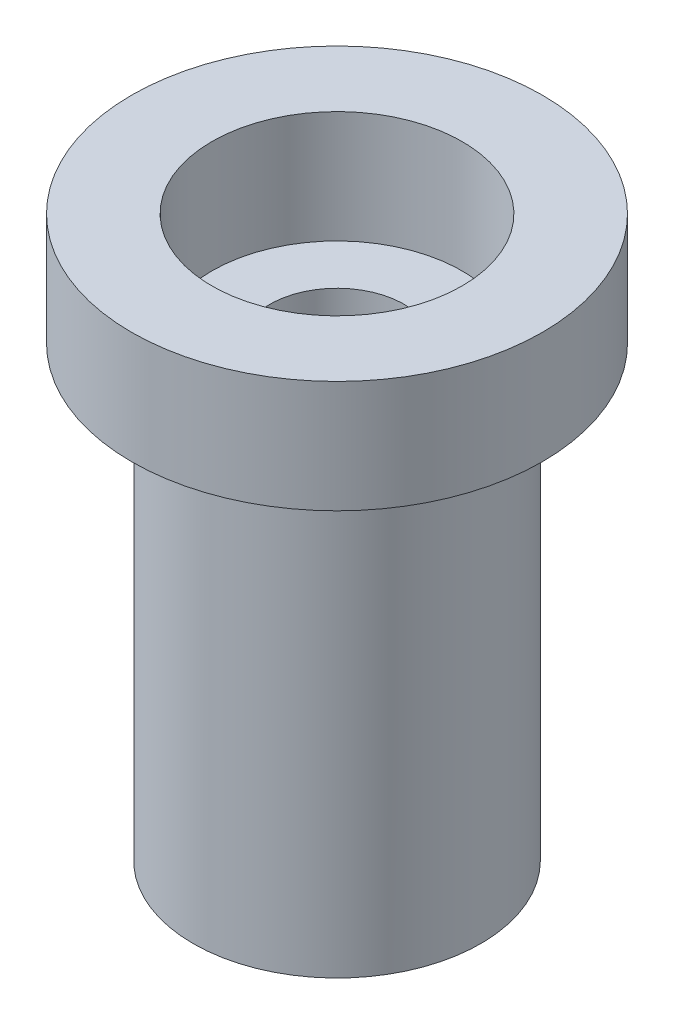
ISO-10303-21;
HEADER;
FILE_DESCRIPTION(('STEP AP214'),'2;1');
FILE_NAME('part.step','',(''),(''),'','','');
FILE_SCHEMA(('AUTOMOTIVE_DESIGN { 1 0 10303 214 1 1 1 1 }'));
ENDSEC;
DATA;
#1=APPLICATION_CONTEXT('core data for automotive mechanical design processes');
#2=APPLICATION_PROTOCOL_DEFINITION('international standard','automotive_design',2000,#1);
#3=PRODUCT_CONTEXT('',#1,'mechanical');
#4=PRODUCT('Part','Part','',(#3));
#5=PRODUCT_RELATED_PRODUCT_CATEGORY('part','',(#4));
#6=PRODUCT_DEFINITION_FORMATION('','',#4);
#7=PRODUCT_DEFINITION_CONTEXT('part definition',#1,'design');
#8=PRODUCT_DEFINITION('design','',#6,#7);
#9=PRODUCT_DEFINITION_SHAPE('','',#8);
#10=(LENGTH_UNIT() NAMED_UNIT(*) SI_UNIT(.MILLI.,.METRE.));
#11=(NAMED_UNIT(*) PLANE_ANGLE_UNIT() SI_UNIT($,.RADIAN.));
#12=(NAMED_UNIT(*) SI_UNIT($,.STERADIAN.) SOLID_ANGLE_UNIT());
#13=UNCERTAINTY_MEASURE_WITH_UNIT(LENGTH_MEASURE(1.E-05),#10,'distance_accuracy_value','');
#14=(GEOMETRIC_REPRESENTATION_CONTEXT(3) GLOBAL_UNCERTAINTY_ASSIGNED_CONTEXT((#13)) GLOBAL_UNIT_ASSIGNED_CONTEXT((#10,
#11,#12)) REPRESENTATION_CONTEXT('',''));
#15=CARTESIAN_POINT('',(0.,0.,0.));
#16=DIRECTION('',(0.,0.,1.));
#17=DIRECTION('',(1.,0.,0.));
#18=AXIS2_PLACEMENT_3D('',#15,#16,#17);
#19=CARTESIAN_POINT('',(99.0185248685556,11.9999999999996,84.1114114208485));
#20=DIRECTION('',(0.,-1.,0.));
#21=DIRECTION('',(-0.773243287088738,0.,-0.634109469233983));
#22=AXIS2_PLACEMENT_3D('',#19,#20,#21);
#23=PLANE('',#22);
#24=CARTESIAN_POINT('',(0.,11.9999999999994,0.));
#25=DIRECTION('',(0.,-1.,0.));
#26=DIRECTION('',(1.,0.,0.));
#27=AXIS2_PLACEMENT_3D('',#24,#25,#26);
#28=CIRCLE('',#27,1.8);
#29=CARTESIAN_POINT('',(1.8,11.9999999999994,0.));
#30=VERTEX_POINT('',#29);
#31=EDGE_CURVE('E10',#30,#30,#28,.T.);
#32=ORIENTED_EDGE('',*,*,#31,.T.);
#33=EDGE_LOOP('',(#32));
#34=FACE_BOUND('',#33,.T.);
#35=CARTESIAN_POINT('',(0.,11.9999999999994,0.));
#36=DIRECTION('',(0.,1.,0.));
#37=DIRECTION('',(-1.,0.,0.));
#38=AXIS2_PLACEMENT_3D('',#35,#36,#37);
#39=CIRCLE('',#38,3.35);
#40=CARTESIAN_POINT('',(-3.35000000000002,11.9999999999994,0.));
#41=VERTEX_POINT('',#40);
#42=EDGE_CURVE('E58',#41,#41,#39,.T.);
#43=ORIENTED_EDGE('',*,*,#42,.T.);
#44=EDGE_LOOP('',(#43));
#45=FACE_BOUND('',#44,.T.);
#46=ADVANCED_FACE('F32',(#34,#45),#23,.F.);
#47=CARTESIAN_POINT('',(0.,0.,0.));
#48=DIRECTION('',(0.,1.,0.));
#49=DIRECTION('',(0.,0.,1.));
#50=AXIS2_PLACEMENT_3D('',#47,#48,#49);
#51=PLANE('',#50);
#52=CARTESIAN_POINT('',(0.,0.,0.));
#53=DIRECTION('',(0.,1.,0.));
#54=DIRECTION('',(0.,0.,1.));
#55=AXIS2_PLACEMENT_3D('',#52,#53,#54);
#56=CIRCLE('',#55,3.85);
#57=CARTESIAN_POINT('',(0.,0.,3.85));
#58=VERTEX_POINT('',#57);
#59=EDGE_CURVE('E38',#58,#58,#56,.T.);
#60=ORIENTED_EDGE('',*,*,#59,.F.);
#61=EDGE_LOOP('',(#60));
#62=FACE_BOUND('',#61,.T.);
#63=CARTESIAN_POINT('',(0.,0.,0.));
#64=DIRECTION('',(0.,1.,0.));
#65=DIRECTION('',(0.,0.,1.));
#66=AXIS2_PLACEMENT_3D('',#63,#64,#65);
#67=CIRCLE('',#66,1.8);
#68=CARTESIAN_POINT('',(0.,0.,1.8));
#69=VERTEX_POINT('',#68);
#70=EDGE_CURVE('E42',#69,#69,#67,.T.);
#71=ORIENTED_EDGE('',*,*,#70,.T.);
#72=EDGE_LOOP('',(#71));
#73=FACE_BOUND('',#72,.T.);
#74=ADVANCED_FACE('F84',(#62,#73),#51,.F.);
#75=CARTESIAN_POINT('',(0.,22.8894444302723,0.));
#76=DIRECTION('',(0.,-1.,0.));
#77=DIRECTION('',(0.,0.,-1.));
#78=AXIS2_PLACEMENT_3D('',#75,#76,#77);
#79=CYLINDRICAL_SURFACE('',#78,3.85);
#80=CARTESIAN_POINT('',(0.,11.9999999999994,0.));
#81=DIRECTION('',(0.,1.,0.));
#82=DIRECTION('',(-1.,0.,0.));
#83=AXIS2_PLACEMENT_3D('',#80,#81,#82);
#84=CIRCLE('',#83,3.85);
#85=CARTESIAN_POINT('',(-3.85,11.9999999999994,0.));
#86=VERTEX_POINT('',#85);
#87=EDGE_CURVE('E47',#86,#86,#84,.T.);
#88=ORIENTED_EDGE('',*,*,#87,.F.);
#89=EDGE_LOOP('',(#88));
#90=FACE_BOUND('',#89,.T.);
#91=ORIENTED_EDGE('',*,*,#59,.T.);
#92=EDGE_LOOP('',(#91));
#93=FACE_BOUND('',#92,.T.);
#94=ADVANCED_FACE('F80',(#90,#93),#79,.T.);
#95=CARTESIAN_POINT('',(0.,22.8894444302723,0.));
#96=DIRECTION('',(0.,-1.,0.));
#97=DIRECTION('',(0.,0.,-1.));
#98=AXIS2_PLACEMENT_3D('',#95,#96,#97);
#99=CYLINDRICAL_SURFACE('',#98,1.8);
#100=ORIENTED_EDGE('',*,*,#31,.F.);
#101=EDGE_LOOP('',(#100));
#102=FACE_BOUND('',#101,.T.);
#103=ORIENTED_EDGE('',*,*,#70,.F.);
#104=EDGE_LOOP('',(#103));
#105=FACE_BOUND('',#104,.T.);
#106=ADVANCED_FACE('F70',(#102,#105),#99,.F.);
#107=CARTESIAN_POINT('',(0.,14.9999999999994,0.));
#108=DIRECTION('',(0.,1.,0.));
#109=DIRECTION('',(-1.,0.,0.));
#110=AXIS2_PLACEMENT_3D('',#107,#108,#109);
#111=PLANE('',#110);
#112=CARTESIAN_POINT('',(0.,14.9999999999994,0.));
#113=DIRECTION('',(0.,1.,0.));
#114=DIRECTION('',(-1.,0.,0.));
#115=AXIS2_PLACEMENT_3D('',#112,#113,#114);
#116=CIRCLE('',#115,5.5);
#117=CARTESIAN_POINT('',(-5.50000000000003,14.9999999999994,0.));
#118=VERTEX_POINT('',#117);
#119=EDGE_CURVE('E51',#118,#118,#116,.T.);
#120=ORIENTED_EDGE('',*,*,#119,.T.);
#121=EDGE_LOOP('',(#120));
#122=FACE_BOUND('',#121,.T.);
#123=CARTESIAN_POINT('',(0.,14.9999999999994,0.));
#124=DIRECTION('',(0.,1.,0.));
#125=DIRECTION('',(-1.,0.,0.));
#126=AXIS2_PLACEMENT_3D('',#123,#124,#125);
#127=CIRCLE('',#126,3.35);
#128=CARTESIAN_POINT('',(-3.35000000000003,14.9999999999994,0.));
#129=VERTEX_POINT('',#128);
#130=EDGE_CURVE('E55',#129,#129,#127,.T.);
#131=ORIENTED_EDGE('',*,*,#130,.F.);
#132=EDGE_LOOP('',(#131));
#133=FACE_BOUND('',#132,.T.);
#134=ADVANCED_FACE('F67',(#122,#133),#111,.T.);
#135=CARTESIAN_POINT('',(0.,11.9999999999994,0.));
#136=DIRECTION('',(0.,1.,0.));
#137=DIRECTION('',(-1.,0.,0.));
#138=AXIS2_PLACEMENT_3D('',#135,#136,#137);
#139=PLANE('',#138);
#140=ORIENTED_EDGE('',*,*,#87,.T.);
#141=EDGE_LOOP('',(#140));
#142=FACE_BOUND('',#141,.T.);
#143=CARTESIAN_POINT('',(0.,11.9999999999994,0.));
#144=DIRECTION('',(0.,1.,0.));
#145=DIRECTION('',(-1.,0.,0.));
#146=AXIS2_PLACEMENT_3D('',#143,#144,#145);
#147=CIRCLE('',#146,5.5);
#148=CARTESIAN_POINT('',(-5.50000000000002,11.9999999999994,0.));
#149=VERTEX_POINT('',#148);
#150=EDGE_CURVE('E52',#149,#149,#147,.T.);
#151=ORIENTED_EDGE('',*,*,#150,.F.);
#152=EDGE_LOOP('',(#151));
#153=FACE_BOUND('',#152,.T.);
#154=ADVANCED_FACE('F69',(#142,#153),#139,.F.);
#155=CARTESIAN_POINT('',(0.,14.9999999999994,0.));
#156=DIRECTION('',(0.,-1.,0.));
#157=DIRECTION('',(1.,0.,0.));
#158=AXIS2_PLACEMENT_3D('',#155,#156,#157);
#159=CYLINDRICAL_SURFACE('',#158,5.5);
#160=ORIENTED_EDGE('',*,*,#119,.F.);
#161=EDGE_LOOP('',(#160));
#162=FACE_BOUND('',#161,.T.);
#163=ORIENTED_EDGE('',*,*,#150,.T.);
#164=EDGE_LOOP('',(#163));
#165=FACE_BOUND('',#164,.T.);
#166=ADVANCED_FACE('F77',(#162,#165),#159,.T.);
#167=CARTESIAN_POINT('',(0.,14.9999999999994,0.));
#168=DIRECTION('',(0.,-1.,0.));
#169=DIRECTION('',(1.,0.,0.));
#170=AXIS2_PLACEMENT_3D('',#167,#168,#169);
#171=CYLINDRICAL_SURFACE('',#170,3.35);
#172=ORIENTED_EDGE('',*,*,#130,.T.);
#173=EDGE_LOOP('',(#172));
#174=FACE_BOUND('',#173,.T.);
#175=ORIENTED_EDGE('',*,*,#42,.F.);
#176=EDGE_LOOP('',(#175));
#177=FACE_BOUND('',#176,.T.);
#178=ADVANCED_FACE('F64',(#174,#177),#171,.F.);
#179=CLOSED_SHELL('',(#46,#74,#94,#106,#134,#154,#166,#178));
#180=MANIFOLD_SOLID_BREP('B2',#179);
#181=ADVANCED_BREP_SHAPE_REPRESENTATION('',(#18,#180),#14);
#182=SHAPE_DEFINITION_REPRESENTATION(#9,#181);
ENDSEC;
END-ISO-10303-21;
